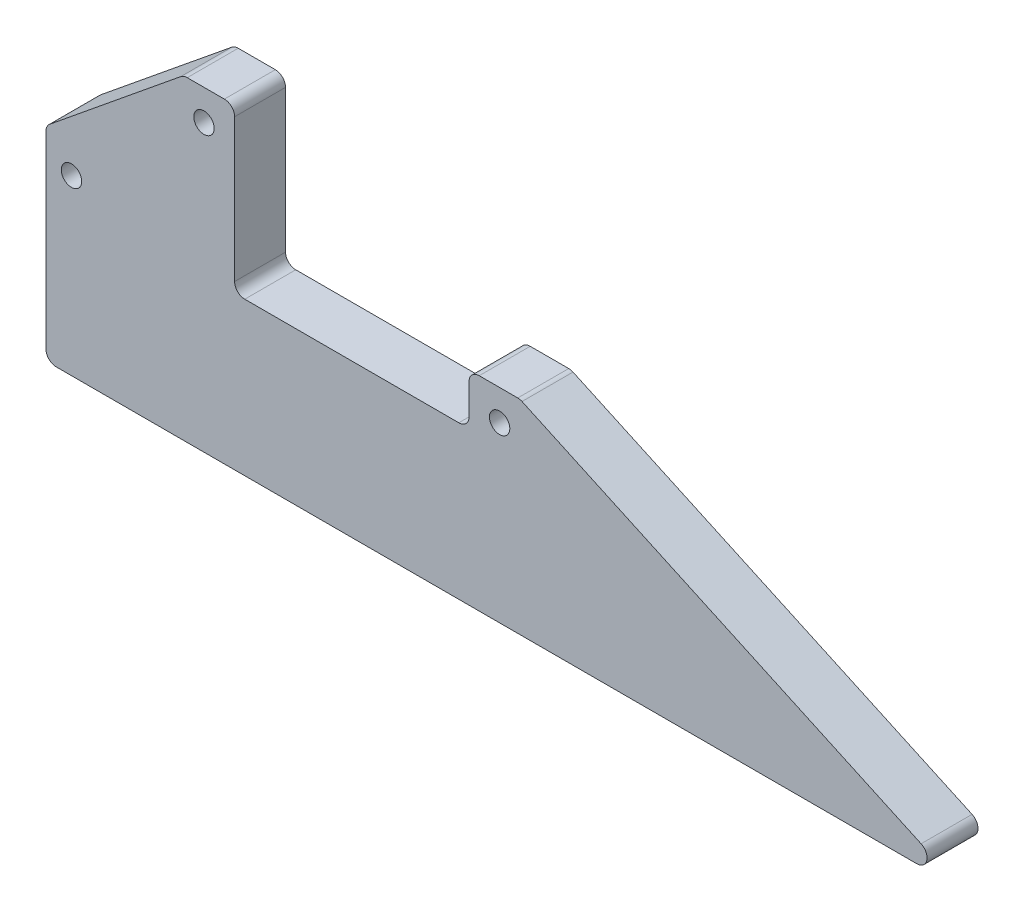
ISO-10303-21;
HEADER;
FILE_DESCRIPTION(('STEP AP214'),'2;1');
FILE_NAME('part.step','',(''),(''),'','','');
FILE_SCHEMA(('AUTOMOTIVE_DESIGN { 1 0 10303 214 1 1 1 1 }'));
ENDSEC;
DATA;
#1=APPLICATION_CONTEXT('core data for automotive mechanical design processes');
#2=APPLICATION_PROTOCOL_DEFINITION('international standard','automotive_design',2000,#1);
#3=PRODUCT_CONTEXT('',#1,'mechanical');
#4=PRODUCT('Part','Part','',(#3));
#5=PRODUCT_RELATED_PRODUCT_CATEGORY('part','',(#4));
#6=PRODUCT_DEFINITION_FORMATION('','',#4);
#7=PRODUCT_DEFINITION_CONTEXT('part definition',#1,'design');
#8=PRODUCT_DEFINITION('design','',#6,#7);
#9=PRODUCT_DEFINITION_SHAPE('','',#8);
#10=(LENGTH_UNIT() NAMED_UNIT(*) SI_UNIT(.MILLI.,.METRE.));
#11=(NAMED_UNIT(*) PLANE_ANGLE_UNIT() SI_UNIT($,.RADIAN.));
#12=(NAMED_UNIT(*) SI_UNIT($,.STERADIAN.) SOLID_ANGLE_UNIT());
#13=UNCERTAINTY_MEASURE_WITH_UNIT(LENGTH_MEASURE(1.E-05),#10,'distance_accuracy_value','');
#14=(GEOMETRIC_REPRESENTATION_CONTEXT(3) GLOBAL_UNCERTAINTY_ASSIGNED_CONTEXT((#13)) GLOBAL_UNIT_ASSIGNED_CONTEXT((#10,
#11,#12)) REPRESENTATION_CONTEXT('',''));
#15=CARTESIAN_POINT('',(0.,0.,0.));
#16=DIRECTION('',(0.,0.,1.));
#17=DIRECTION('',(1.,0.,0.));
#18=AXIS2_PLACEMENT_3D('',#15,#16,#17);
#19=CARTESIAN_POINT('',(-153.,62.,10.));
#20=DIRECTION('',(0.631672951162236,-0.775234985517289,0.));
#21=DIRECTION('',(0.775234985517289,0.631672951162236,0.));
#22=AXIS2_PLACEMENT_3D('',#19,#20,#21);
#23=PLANE('',#22);
#24=DIRECTION('',(-0.775234985517289,-0.631672951162236,0.));
#25=VECTOR('',#24,1.);
#26=CARTESIAN_POINT('',(-153.,62.,0.));
#27=LINE('',#26,#25);
#28=CARTESIAN_POINT('',(-153.551695944639,61.5504699710346,0.));
#29=VERTEX_POINT('',#28);
#30=CARTESIAN_POINT('',(-179.263345902324,40.6002366721801,0.));
#31=VERTEX_POINT('',#30);
#32=EDGE_CURVE('E290',#29,#31,#27,.T.);
#33=ORIENTED_EDGE('',*,*,#32,.T.);
#34=DIRECTION('',(0.,0.,-1.));
#35=VECTOR('',#34,1.);
#36=CARTESIAN_POINT('',(-179.263345902324,40.60023667218,10.));
#37=LINE('',#36,#35);
#38=CARTESIAN_POINT('',(-179.263345902324,40.6002366721801,10.));
#39=VERTEX_POINT('',#38);
#40=EDGE_CURVE('E257',#31,#39,#37,.F.);
#41=ORIENTED_EDGE('',*,*,#40,.T.);
#42=DIRECTION('',(-0.775234985517289,-0.631672951162236,0.));
#43=VECTOR('',#42,1.);
#44=CARTESIAN_POINT('',(-153.,62.,10.));
#45=LINE('',#44,#43);
#46=CARTESIAN_POINT('',(-153.551695944639,61.5504699710346,10.));
#47=VERTEX_POINT('',#46);
#48=EDGE_CURVE('E192',#47,#39,#45,.T.);
#49=ORIENTED_EDGE('',*,*,#48,.F.);
#50=DIRECTION('',(0.,0.,-1.));
#51=VECTOR('',#50,1.);
#52=CARTESIAN_POINT('',(-153.551695944639,61.5504699710346,10.));
#53=LINE('',#52,#51);
#54=EDGE_CURVE('E254',#47,#29,#53,.T.);
#55=ORIENTED_EDGE('',*,*,#54,.T.);
#56=EDGE_LOOP('',(#33,#41,#49,#55));
#57=FACE_BOUND('',#56,.T.);
#58=ADVANCED_FACE('F37',(#57),#23,.F.);
#59=CARTESIAN_POINT('',(-180.,40.,10.));
#60=DIRECTION('',(1.,0.,0.));
#61=DIRECTION('',(0.,0.,-1.));
#62=AXIS2_PLACEMENT_3D('',#59,#60,#61);
#63=PLANE('',#62);
#64=DIRECTION('',(0.,-1.,0.));
#65=VECTOR('',#64,1.);
#66=CARTESIAN_POINT('',(-180.,40.,0.));
#67=LINE('',#66,#65);
#68=CARTESIAN_POINT('',(-180.,39.0497667011455,0.));
#69=VERTEX_POINT('',#68);
#70=CARTESIAN_POINT('',(-180.,1.99999999999998,0.));
#71=VERTEX_POINT('',#70);
#72=EDGE_CURVE('E293',#69,#71,#67,.T.);
#73=ORIENTED_EDGE('',*,*,#72,.T.);
#74=DIRECTION('',(0.,0.,-1.));
#75=VECTOR('',#74,1.);
#76=CARTESIAN_POINT('',(-180.,1.99999999999997,10.));
#77=LINE('',#76,#75);
#78=CARTESIAN_POINT('',(-180.,1.99999999999998,10.));
#79=VERTEX_POINT('',#78);
#80=EDGE_CURVE('E252',#71,#79,#77,.F.);
#81=ORIENTED_EDGE('',*,*,#80,.T.);
#82=DIRECTION('',(0.,-1.,0.));
#83=VECTOR('',#82,1.);
#84=CARTESIAN_POINT('',(-180.,40.,10.));
#85=LINE('',#84,#83);
#86=CARTESIAN_POINT('',(-180.,39.0497667011455,10.));
#87=VERTEX_POINT('',#86);
#88=EDGE_CURVE('E321',#87,#79,#85,.T.);
#89=ORIENTED_EDGE('',*,*,#88,.F.);
#90=DIRECTION('',(0.,0.,-1.));
#91=VECTOR('',#90,1.);
#92=CARTESIAN_POINT('',(-180.,39.0497667011455,10.));
#93=LINE('',#92,#91);
#94=EDGE_CURVE('E249',#87,#69,#93,.T.);
#95=ORIENTED_EDGE('',*,*,#94,.T.);
#96=EDGE_LOOP('',(#73,#81,#89,#95));
#97=FACE_BOUND('',#96,.T.);
#98=ADVANCED_FACE('F369',(#97),#63,.F.);
#99=CARTESIAN_POINT('',(0.,0.,10.));
#100=DIRECTION('',(0.,1.,0.));
#101=DIRECTION('',(-1.,0.,0.));
#102=AXIS2_PLACEMENT_3D('',#99,#100,#101);
#103=PLANE('',#102);
#104=DIRECTION('',(1.,0.,0.));
#105=VECTOR('',#104,1.);
#106=CARTESIAN_POINT('',(0.,0.,0.));
#107=LINE('',#106,#105);
#108=CARTESIAN_POINT('',(-178.,0.,0.));
#109=VERTEX_POINT('',#108);
#110=CARTESIAN_POINT('',(-9.13774477181063,0.,0.));
#111=VERTEX_POINT('',#110);
#112=EDGE_CURVE('E297',#109,#111,#107,.T.);
#113=ORIENTED_EDGE('',*,*,#112,.T.);
#114=DIRECTION('',(0.,0.,-1.));
#115=VECTOR('',#114,1.);
#116=CARTESIAN_POINT('',(-9.13774477181063,0.,10.));
#117=LINE('',#116,#115);
#118=CARTESIAN_POINT('',(-9.13774477181063,0.,10.));
#119=VERTEX_POINT('',#118);
#120=EDGE_CURVE('E247',#111,#119,#117,.F.);
#121=ORIENTED_EDGE('',*,*,#120,.T.);
#122=DIRECTION('',(1.,0.,0.));
#123=VECTOR('',#122,1.);
#124=CARTESIAN_POINT('',(0.,0.,10.));
#125=LINE('',#124,#123);
#126=CARTESIAN_POINT('',(-178.,0.,10.));
#127=VERTEX_POINT('',#126);
#128=EDGE_CURVE('E316',#127,#119,#125,.T.);
#129=ORIENTED_EDGE('',*,*,#128,.F.);
#130=DIRECTION('',(0.,0.,-1.));
#131=VECTOR('',#130,1.);
#132=CARTESIAN_POINT('',(-178.,0.,10.));
#133=LINE('',#132,#131);
#134=EDGE_CURVE('E244',#127,#109,#133,.T.);
#135=ORIENTED_EDGE('',*,*,#134,.T.);
#136=EDGE_LOOP('',(#113,#121,#129,#135));
#137=FACE_BOUND('',#136,.T.);
#138=ADVANCED_FACE('F375',(#137),#103,.F.);
#139=CARTESIAN_POINT('',(-87.,40.,10.));
#140=DIRECTION('',(-0.417733211631421,-0.908569735298342,0.));
#141=DIRECTION('',(0.908569735298342,-0.417733211631421,0.));
#142=AXIS2_PLACEMENT_3D('',#139,#140,#141);
#143=PLANE('',#142);
#144=DIRECTION('',(-0.908569735298341,0.417733211631421,0.));
#145=VECTOR('',#144,1.);
#146=CARTESIAN_POINT('',(-87.,40.,0.));
#147=LINE('',#146,#145);
#148=CARTESIAN_POINT('',(-8.30227834854781,3.81713947059669,0.));
#149=VERTEX_POINT('',#148);
#150=CARTESIAN_POINT('',(-86.6022783485478,39.8171394705967,0.));
#151=VERTEX_POINT('',#150);
#152=EDGE_CURVE('E300',#149,#151,#147,.T.);
#153=ORIENTED_EDGE('',*,*,#152,.T.);
#154=DIRECTION('',(0.,0.,-1.));
#155=VECTOR('',#154,1.);
#156=CARTESIAN_POINT('',(-86.6022783485478,39.8171394705967,10.));
#157=LINE('',#156,#155);
#158=CARTESIAN_POINT('',(-86.6022783485478,39.8171394705967,10.));
#159=VERTEX_POINT('',#158);
#160=EDGE_CURVE('E242',#151,#159,#157,.F.);
#161=ORIENTED_EDGE('',*,*,#160,.T.);
#162=DIRECTION('',(-0.908569735298341,0.417733211631421,0.));
#163=VECTOR('',#162,1.);
#164=CARTESIAN_POINT('',(-87.,40.,10.));
#165=LINE('',#164,#163);
#166=CARTESIAN_POINT('',(-8.30227834854781,3.81713947059669,10.));
#167=VERTEX_POINT('',#166);
#168=EDGE_CURVE('E315',#167,#159,#165,.T.);
#169=ORIENTED_EDGE('',*,*,#168,.F.);
#170=DIRECTION('',(0.,0.,-1.));
#171=VECTOR('',#170,1.);
#172=CARTESIAN_POINT('',(-8.30227834854777,3.81713947059668,10.));
#173=LINE('',#172,#171);
#174=EDGE_CURVE('E239',#167,#149,#173,.T.);
#175=ORIENTED_EDGE('',*,*,#174,.T.);
#176=EDGE_LOOP('',(#153,#161,#169,#175));
#177=FACE_BOUND('',#176,.T.);
#178=ADVANCED_FACE('F428',(#177),#143,.F.);
#179=CARTESIAN_POINT('',(-97.,40.,10.));
#180=DIRECTION('',(0.,-1.,0.));
#181=DIRECTION('',(0.,0.,-1.));
#182=AXIS2_PLACEMENT_3D('',#179,#180,#181);
#183=PLANE('',#182);
#184=DIRECTION('',(-1.,0.,0.));
#185=VECTOR('',#184,1.);
#186=CARTESIAN_POINT('',(-97.,40.,0.));
#187=LINE('',#186,#185);
#188=CARTESIAN_POINT('',(-87.4377447718106,40.,0.));
#189=VERTEX_POINT('',#188);
#190=CARTESIAN_POINT('',(-95.,40.,0.));
#191=VERTEX_POINT('',#190);
#192=EDGE_CURVE('E272',#189,#191,#187,.T.);
#193=ORIENTED_EDGE('',*,*,#192,.T.);
#194=DIRECTION('',(0.,0.,-1.));
#195=VECTOR('',#194,1.);
#196=CARTESIAN_POINT('',(-95.,40.,10.));
#197=LINE('',#196,#195);
#198=CARTESIAN_POINT('',(-95.,40.,10.));
#199=VERTEX_POINT('',#198);
#200=EDGE_CURVE('E224',#191,#199,#197,.F.);
#201=ORIENTED_EDGE('',*,*,#200,.T.);
#202=DIRECTION('',(-1.,0.,0.));
#203=VECTOR('',#202,1.);
#204=CARTESIAN_POINT('',(-97.,40.,10.));
#205=LINE('',#204,#203);
#206=CARTESIAN_POINT('',(-87.4377447718106,40.,10.));
#207=VERTEX_POINT('',#206);
#208=EDGE_CURVE('E285',#207,#199,#205,.T.);
#209=ORIENTED_EDGE('',*,*,#208,.F.);
#210=DIRECTION('',(0.,0.,-1.));
#211=VECTOR('',#210,1.);
#212=CARTESIAN_POINT('',(-87.4377447718106,40.,10.));
#213=LINE('',#212,#211);
#214=EDGE_CURVE('E221',#207,#189,#213,.T.);
#215=ORIENTED_EDGE('',*,*,#214,.T.);
#216=EDGE_LOOP('',(#193,#201,#209,#215));
#217=FACE_BOUND('',#216,.T.);
#218=ADVANCED_FACE('F307',(#217),#183,.F.);
#219=CARTESIAN_POINT('',(-97.,30.,10.));
#220=DIRECTION('',(1.,0.,0.));
#221=DIRECTION('',(0.,0.,-1.));
#222=AXIS2_PLACEMENT_3D('',#219,#220,#221);
#223=PLANE('',#222);
#224=DIRECTION('',(0.,-1.,0.));
#225=VECTOR('',#224,1.);
#226=CARTESIAN_POINT('',(-97.,30.,0.));
#227=LINE('',#226,#225);
#228=CARTESIAN_POINT('',(-97.,38.,0.));
#229=VERTEX_POINT('',#228);
#230=CARTESIAN_POINT('',(-97.,32.,0.));
#231=VERTEX_POINT('',#230);
#232=EDGE_CURVE('E194',#229,#231,#227,.T.);
#233=ORIENTED_EDGE('',*,*,#232,.T.);
#234=DIRECTION('',(0.,0.,-1.));
#235=VECTOR('',#234,1.);
#236=CARTESIAN_POINT('',(-97.,32.,10.));
#237=LINE('',#236,#235);
#238=CARTESIAN_POINT('',(-97.,32.,10.));
#239=VERTEX_POINT('',#238);
#240=EDGE_CURVE('E206',#231,#239,#237,.F.);
#241=ORIENTED_EDGE('',*,*,#240,.T.);
#242=DIRECTION('',(0.,-1.,0.));
#243=VECTOR('',#242,1.);
#244=CARTESIAN_POINT('',(-97.,30.,10.));
#245=LINE('',#244,#243);
#246=CARTESIAN_POINT('',(-97.,38.,10.));
#247=VERTEX_POINT('',#246);
#248=EDGE_CURVE('E280',#247,#239,#245,.T.);
#249=ORIENTED_EDGE('',*,*,#248,.F.);
#250=DIRECTION('',(0.,0.,-1.));
#251=VECTOR('',#250,1.);
#252=CARTESIAN_POINT('',(-97.,38.,10.));
#253=LINE('',#252,#251);
#254=EDGE_CURVE('E203',#247,#229,#253,.T.);
#255=ORIENTED_EDGE('',*,*,#254,.T.);
#256=EDGE_LOOP('',(#233,#241,#249,#255));
#257=FACE_BOUND('',#256,.T.);
#258=ADVANCED_FACE('F268',(#257),#223,.F.);
#259=CARTESIAN_POINT('',(-143.,30.,10.));
#260=DIRECTION('',(0.,-1.,0.));
#261=DIRECTION('',(1.,0.,0.));
#262=AXIS2_PLACEMENT_3D('',#259,#260,#261);
#263=PLANE('',#262);
#264=DIRECTION('',(-1.,0.,0.));
#265=VECTOR('',#264,1.);
#266=CARTESIAN_POINT('',(-143.,30.,0.));
#267=LINE('',#266,#265);
#268=CARTESIAN_POINT('',(-99.,30.,0.));
#269=VERTEX_POINT('',#268);
#270=CARTESIAN_POINT('',(-141.,30.,0.));
#271=VERTEX_POINT('',#270);
#272=EDGE_CURVE('E190',#269,#271,#267,.T.);
#273=ORIENTED_EDGE('',*,*,#272,.T.);
#274=DIRECTION('',(0.,0.,-1.));
#275=VECTOR('',#274,1.);
#276=CARTESIAN_POINT('',(-141.,30.,10.));
#277=LINE('',#276,#275);
#278=CARTESIAN_POINT('',(-141.,30.,10.));
#279=VERTEX_POINT('',#278);
#280=EDGE_CURVE('E168',#271,#279,#277,.F.);
#281=ORIENTED_EDGE('',*,*,#280,.T.);
#282=DIRECTION('',(-1.,0.,0.));
#283=VECTOR('',#282,1.);
#284=CARTESIAN_POINT('',(-143.,30.,10.));
#285=LINE('',#284,#283);
#286=CARTESIAN_POINT('',(-99.,30.,10.));
#287=VERTEX_POINT('',#286);
#288=EDGE_CURVE('E279',#287,#279,#285,.T.);
#289=ORIENTED_EDGE('',*,*,#288,.F.);
#290=DIRECTION('',(0.,0.,-1.));
#291=VECTOR('',#290,1.);
#292=CARTESIAN_POINT('',(-99.,30.,0.));
#293=LINE('',#292,#291);
#294=EDGE_CURVE('E182',#287,#269,#293,.T.);
#295=ORIENTED_EDGE('',*,*,#294,.T.);
#296=EDGE_LOOP('',(#273,#281,#289,#295));
#297=FACE_BOUND('',#296,.T.);
#298=ADVANCED_FACE('F282',(#297),#263,.F.);
#299=CARTESIAN_POINT('',(-143.,62.,10.));
#300=DIRECTION('',(-1.,0.,0.));
#301=DIRECTION('',(0.,0.,1.));
#302=AXIS2_PLACEMENT_3D('',#299,#300,#301);
#303=PLANE('',#302);
#304=DIRECTION('',(0.,1.,0.));
#305=VECTOR('',#304,1.);
#306=CARTESIAN_POINT('',(-143.,62.,10.));
#307=LINE('',#306,#305);
#308=CARTESIAN_POINT('',(-143.,32.,10.));
#309=VERTEX_POINT('',#308);
#310=CARTESIAN_POINT('',(-143.,60.,10.));
#311=VERTEX_POINT('',#310);
#312=EDGE_CURVE('E181',#309,#311,#307,.T.);
#313=ORIENTED_EDGE('',*,*,#312,.F.);
#314=DIRECTION('',(0.,0.,-1.));
#315=VECTOR('',#314,1.);
#316=CARTESIAN_POINT('',(-143.,32.,0.));
#317=LINE('',#316,#315);
#318=CARTESIAN_POINT('',(-143.,32.,0.));
#319=VERTEX_POINT('',#318);
#320=EDGE_CURVE('E167',#309,#319,#317,.T.);
#321=ORIENTED_EDGE('',*,*,#320,.T.);
#322=DIRECTION('',(0.,1.,0.));
#323=VECTOR('',#322,1.);
#324=CARTESIAN_POINT('',(-143.,62.,0.));
#325=LINE('',#324,#323);
#326=CARTESIAN_POINT('',(-143.,60.,0.));
#327=VERTEX_POINT('',#326);
#328=EDGE_CURVE('E179',#319,#327,#325,.T.);
#329=ORIENTED_EDGE('',*,*,#328,.T.);
#330=DIRECTION('',(0.,0.,-1.));
#331=VECTOR('',#330,1.);
#332=CARTESIAN_POINT('',(-143.,60.,10.));
#333=LINE('',#332,#331);
#334=EDGE_CURVE('E183',#327,#311,#333,.F.);
#335=ORIENTED_EDGE('',*,*,#334,.T.);
#336=EDGE_LOOP('',(#313,#321,#329,#335));
#337=FACE_BOUND('',#336,.T.);
#338=ADVANCED_FACE('F178',(#337),#303,.F.);
#339=CARTESIAN_POINT('',(-153.,62.,10.));
#340=DIRECTION('',(0.,-1.,0.));
#341=DIRECTION('',(0.,0.,-1.));
#342=AXIS2_PLACEMENT_3D('',#339,#340,#341);
#343=PLANE('',#342);
#344=DIRECTION('',(-1.,0.,0.));
#345=VECTOR('',#344,1.);
#346=CARTESIAN_POINT('',(-153.,62.,0.));
#347=LINE('',#346,#345);
#348=CARTESIAN_POINT('',(-145.,62.,0.));
#349=VERTEX_POINT('',#348);
#350=CARTESIAN_POINT('',(-152.288350042315,62.,0.));
#351=VERTEX_POINT('',#350);
#352=EDGE_CURVE('E189',#349,#351,#347,.T.);
#353=ORIENTED_EDGE('',*,*,#352,.T.);
#354=DIRECTION('',(0.,0.,-1.));
#355=VECTOR('',#354,1.);
#356=CARTESIAN_POINT('',(-152.288350042315,62.,10.));
#357=LINE('',#356,#355);
#358=CARTESIAN_POINT('',(-152.288350042315,62.,10.));
#359=VERTEX_POINT('',#358);
#360=EDGE_CURVE('E52',#351,#359,#357,.F.);
#361=ORIENTED_EDGE('',*,*,#360,.T.);
#362=DIRECTION('',(-1.,0.,0.));
#363=VECTOR('',#362,1.);
#364=CARTESIAN_POINT('',(-153.,62.,10.));
#365=LINE('',#364,#363);
#366=CARTESIAN_POINT('',(-145.,62.,10.));
#367=VERTEX_POINT('',#366);
#368=EDGE_CURVE('E198',#367,#359,#365,.T.);
#369=ORIENTED_EDGE('',*,*,#368,.F.);
#370=DIRECTION('',(0.,0.,-1.));
#371=VECTOR('',#370,1.);
#372=CARTESIAN_POINT('',(-145.,62.,10.));
#373=LINE('',#372,#371);
#374=EDGE_CURVE('E259',#367,#349,#373,.T.);
#375=ORIENTED_EDGE('',*,*,#374,.T.);
#376=EDGE_LOOP('',(#353,#361,#369,#375));
#377=FACE_BOUND('',#376,.T.);
#378=ADVANCED_FACE('F348',(#377),#343,.F.);
#379=CARTESIAN_POINT('',(0.,0.,10.));
#380=DIRECTION('',(0.,0.,1.));
#381=DIRECTION('',(1.,0.,0.));
#382=AXIS2_PLACEMENT_3D('',#379,#380,#381);
#383=PLANE('',#382);
#384=CARTESIAN_POINT('',(-149.,56.,10.));
#385=DIRECTION('',(0.,0.,1.));
#386=DIRECTION('',(1.,0.,0.));
#387=AXIS2_PLACEMENT_3D('',#384,#385,#386);
#388=CIRCLE('',#387,1.99999999999997);
#389=CARTESIAN_POINT('',(-147.,56.,10.));
#390=VERTEX_POINT('',#389);
#391=EDGE_CURVE('E340',#390,#390,#388,.T.);
#392=ORIENTED_EDGE('',*,*,#391,.F.);
#393=EDGE_LOOP('',(#392));
#394=FACE_BOUND('',#393,.T.);
#395=CARTESIAN_POINT('',(-90.9999999999999,34.,10.));
#396=DIRECTION('',(0.,0.,1.));
#397=DIRECTION('',(1.,0.,0.));
#398=AXIS2_PLACEMENT_3D('',#395,#396,#397);
#399=CIRCLE('',#398,1.99999999999999);
#400=CARTESIAN_POINT('',(-88.9999999999999,34.,10.));
#401=VERTEX_POINT('',#400);
#402=EDGE_CURVE('E334',#401,#401,#399,.T.);
#403=ORIENTED_EDGE('',*,*,#402,.F.);
#404=EDGE_LOOP('',(#403));
#405=FACE_BOUND('',#404,.T.);
#406=CARTESIAN_POINT('',(-175.,34.,10.));
#407=DIRECTION('',(0.,0.,1.));
#408=DIRECTION('',(1.,0.,0.));
#409=AXIS2_PLACEMENT_3D('',#406,#407,#408);
#410=CIRCLE('',#409,2.);
#411=CARTESIAN_POINT('',(-173.,34.,10.));
#412=VERTEX_POINT('',#411);
#413=EDGE_CURVE('E328',#412,#412,#410,.T.);
#414=ORIENTED_EDGE('',*,*,#413,.F.);
#415=EDGE_LOOP('',(#414));
#416=FACE_BOUND('',#415,.T.);
#417=ORIENTED_EDGE('',*,*,#208,.T.);
#418=CARTESIAN_POINT('',(-95.,38.,10.));
#419=DIRECTION('',(0.,0.,1.));
#420=DIRECTION('',(1.,0.,0.));
#421=AXIS2_PLACEMENT_3D('',#418,#419,#420);
#422=CIRCLE('',#421,2.);
#423=EDGE_CURVE('E237',#199,#247,#422,.T.);
#424=ORIENTED_EDGE('',*,*,#423,.T.);
#425=ORIENTED_EDGE('',*,*,#248,.T.);
#426=CARTESIAN_POINT('',(-99.,32.,10.));
#427=DIRECTION('',(0.,0.,1.));
#428=DIRECTION('',(1.,0.,0.));
#429=AXIS2_PLACEMENT_3D('',#426,#427,#428);
#430=CIRCLE('',#429,2.);
#431=EDGE_CURVE('E11',#239,#287,#430,.F.);
#432=ORIENTED_EDGE('',*,*,#431,.T.);
#433=ORIENTED_EDGE('',*,*,#288,.T.);
#434=CARTESIAN_POINT('',(-141.,32.,10.));
#435=DIRECTION('',(0.,0.,1.));
#436=DIRECTION('',(1.,0.,0.));
#437=AXIS2_PLACEMENT_3D('',#434,#435,#436);
#438=CIRCLE('',#437,2.);
#439=EDGE_CURVE('E173',#279,#309,#438,.F.);
#440=ORIENTED_EDGE('',*,*,#439,.T.);
#441=ORIENTED_EDGE('',*,*,#312,.T.);
#442=CARTESIAN_POINT('',(-145.,60.,10.));
#443=DIRECTION('',(0.,0.,1.));
#444=DIRECTION('',(1.,0.,0.));
#445=AXIS2_PLACEMENT_3D('',#442,#443,#444);
#446=CIRCLE('',#445,2.);
#447=EDGE_CURVE('E59',#311,#367,#446,.T.);
#448=ORIENTED_EDGE('',*,*,#447,.T.);
#449=ORIENTED_EDGE('',*,*,#368,.T.);
#450=CARTESIAN_POINT('',(-152.288350042315,60.,10.));
#451=DIRECTION('',(0.,0.,1.));
#452=DIRECTION('',(1.,0.,0.));
#453=AXIS2_PLACEMENT_3D('',#450,#451,#452);
#454=CIRCLE('',#453,2.);
#455=EDGE_CURVE('E227',#359,#47,#454,.T.);
#456=ORIENTED_EDGE('',*,*,#455,.T.);
#457=ORIENTED_EDGE('',*,*,#48,.T.);
#458=CARTESIAN_POINT('',(-178.,39.0497667011455,10.));
#459=DIRECTION('',(0.,0.,1.));
#460=DIRECTION('',(1.,0.,0.));
#461=AXIS2_PLACEMENT_3D('',#458,#459,#460);
#462=CIRCLE('',#461,2.);
#463=EDGE_CURVE('E229',#39,#87,#462,.T.);
#464=ORIENTED_EDGE('',*,*,#463,.T.);
#465=ORIENTED_EDGE('',*,*,#88,.T.);
#466=CARTESIAN_POINT('',(-178.,1.99999999999997,10.));
#467=DIRECTION('',(0.,0.,1.));
#468=DIRECTION('',(1.,0.,0.));
#469=AXIS2_PLACEMENT_3D('',#466,#467,#468);
#470=CIRCLE('',#469,2.);
#471=EDGE_CURVE('E231',#79,#127,#470,.T.);
#472=ORIENTED_EDGE('',*,*,#471,.T.);
#473=ORIENTED_EDGE('',*,*,#128,.T.);
#474=CARTESIAN_POINT('',(-9.13774477181063,2.,10.));
#475=DIRECTION('',(0.,0.,1.));
#476=DIRECTION('',(1.,0.,0.));
#477=AXIS2_PLACEMENT_3D('',#474,#475,#476);
#478=CIRCLE('',#477,2.);
#479=EDGE_CURVE('E233',#119,#167,#478,.T.);
#480=ORIENTED_EDGE('',*,*,#479,.T.);
#481=ORIENTED_EDGE('',*,*,#168,.T.);
#482=CARTESIAN_POINT('',(-87.4377447718106,38.,10.));
#483=DIRECTION('',(0.,0.,1.));
#484=DIRECTION('',(1.,0.,0.));
#485=AXIS2_PLACEMENT_3D('',#482,#483,#484);
#486=CIRCLE('',#485,2.);
#487=EDGE_CURVE('E235',#159,#207,#486,.T.);
#488=ORIENTED_EDGE('',*,*,#487,.T.);
#489=EDGE_LOOP('',(#417,#424,#425,#432,#433,#440,#441,#448,#449,#456,#457,#464,#465,#472,#473,
#480,#481,#488));
#490=FACE_BOUND('',#489,.T.);
#491=ADVANCED_FACE('F278',(#394,#405,#416,#490),#383,.T.);
#492=CARTESIAN_POINT('',(0.,0.,0.));
#493=DIRECTION('',(0.,0.,1.));
#494=DIRECTION('',(1.,0.,0.));
#495=AXIS2_PLACEMENT_3D('',#492,#493,#494);
#496=PLANE('',#495);
#497=CARTESIAN_POINT('',(-149.,56.,0.));
#498=DIRECTION('',(0.,0.,1.));
#499=DIRECTION('',(1.,0.,0.));
#500=AXIS2_PLACEMENT_3D('',#497,#498,#499);
#501=CIRCLE('',#500,1.99999999999997);
#502=CARTESIAN_POINT('',(-147.,56.,0.));
#503=VERTEX_POINT('',#502);
#504=EDGE_CURVE('E337',#503,#503,#501,.T.);
#505=ORIENTED_EDGE('',*,*,#504,.T.);
#506=EDGE_LOOP('',(#505));
#507=FACE_BOUND('',#506,.T.);
#508=CARTESIAN_POINT('',(-90.9999999999999,34.,0.));
#509=DIRECTION('',(0.,0.,1.));
#510=DIRECTION('',(1.,0.,0.));
#511=AXIS2_PLACEMENT_3D('',#508,#509,#510);
#512=CIRCLE('',#511,1.99999999999999);
#513=CARTESIAN_POINT('',(-88.9999999999999,34.,0.));
#514=VERTEX_POINT('',#513);
#515=EDGE_CURVE('E331',#514,#514,#512,.T.);
#516=ORIENTED_EDGE('',*,*,#515,.T.);
#517=EDGE_LOOP('',(#516));
#518=FACE_BOUND('',#517,.T.);
#519=CARTESIAN_POINT('',(-175.,34.,0.));
#520=DIRECTION('',(0.,0.,1.));
#521=DIRECTION('',(1.,0.,0.));
#522=AXIS2_PLACEMENT_3D('',#519,#520,#521);
#523=CIRCLE('',#522,1.99999999999997);
#524=CARTESIAN_POINT('',(-173.,34.,0.));
#525=VERTEX_POINT('',#524);
#526=EDGE_CURVE('E294',#525,#525,#523,.T.);
#527=ORIENTED_EDGE('',*,*,#526,.T.);
#528=EDGE_LOOP('',(#527));
#529=FACE_BOUND('',#528,.T.);
#530=ORIENTED_EDGE('',*,*,#232,.F.);
#531=CARTESIAN_POINT('',(-95.,38.,0.));
#532=DIRECTION('',(0.,0.,1.));
#533=DIRECTION('',(1.,0.,0.));
#534=AXIS2_PLACEMENT_3D('',#531,#532,#533);
#535=CIRCLE('',#534,2.);
#536=EDGE_CURVE('E219',#229,#191,#535,.F.);
#537=ORIENTED_EDGE('',*,*,#536,.T.);
#538=ORIENTED_EDGE('',*,*,#192,.F.);
#539=CARTESIAN_POINT('',(-87.4377447718106,38.,0.));
#540=DIRECTION('',(0.,0.,1.));
#541=DIRECTION('',(1.,0.,0.));
#542=AXIS2_PLACEMENT_3D('',#539,#540,#541);
#543=CIRCLE('',#542,2.);
#544=EDGE_CURVE('E217',#189,#151,#543,.F.);
#545=ORIENTED_EDGE('',*,*,#544,.T.);
#546=ORIENTED_EDGE('',*,*,#152,.F.);
#547=CARTESIAN_POINT('',(-9.13774477181063,2.,0.));
#548=DIRECTION('',(0.,0.,1.));
#549=DIRECTION('',(1.,0.,0.));
#550=AXIS2_PLACEMENT_3D('',#547,#548,#549);
#551=CIRCLE('',#550,2.);
#552=EDGE_CURVE('E215',#149,#111,#551,.F.);
#553=ORIENTED_EDGE('',*,*,#552,.T.);
#554=ORIENTED_EDGE('',*,*,#112,.F.);
#555=CARTESIAN_POINT('',(-178.,1.99999999999997,0.));
#556=DIRECTION('',(0.,0.,1.));
#557=DIRECTION('',(1.,0.,0.));
#558=AXIS2_PLACEMENT_3D('',#555,#556,#557);
#559=CIRCLE('',#558,2.);
#560=EDGE_CURVE('E213',#109,#71,#559,.F.);
#561=ORIENTED_EDGE('',*,*,#560,.T.);
#562=ORIENTED_EDGE('',*,*,#72,.F.);
#563=CARTESIAN_POINT('',(-178.,39.0497667011455,0.));
#564=DIRECTION('',(0.,0.,1.));
#565=DIRECTION('',(1.,0.,0.));
#566=AXIS2_PLACEMENT_3D('',#563,#564,#565);
#567=CIRCLE('',#566,2.);
#568=EDGE_CURVE('E211',#69,#31,#567,.F.);
#569=ORIENTED_EDGE('',*,*,#568,.T.);
#570=ORIENTED_EDGE('',*,*,#32,.F.);
#571=CARTESIAN_POINT('',(-152.288350042315,60.,0.));
#572=DIRECTION('',(0.,0.,1.));
#573=DIRECTION('',(1.,0.,0.));
#574=AXIS2_PLACEMENT_3D('',#571,#572,#573);
#575=CIRCLE('',#574,2.);
#576=EDGE_CURVE('E209',#29,#351,#575,.F.);
#577=ORIENTED_EDGE('',*,*,#576,.T.);
#578=ORIENTED_EDGE('',*,*,#352,.F.);
#579=CARTESIAN_POINT('',(-145.,60.,0.));
#580=DIRECTION('',(0.,0.,1.));
#581=DIRECTION('',(1.,0.,0.));
#582=AXIS2_PLACEMENT_3D('',#579,#580,#581);
#583=CIRCLE('',#582,2.);
#584=EDGE_CURVE('E188',#349,#327,#583,.F.);
#585=ORIENTED_EDGE('',*,*,#584,.T.);
#586=ORIENTED_EDGE('',*,*,#328,.F.);
#587=CARTESIAN_POINT('',(-141.,32.,0.));
#588=DIRECTION('',(0.,0.,1.));
#589=DIRECTION('',(1.,0.,0.));
#590=AXIS2_PLACEMENT_3D('',#587,#588,#589);
#591=CIRCLE('',#590,2.);
#592=EDGE_CURVE('E163',#319,#271,#591,.T.);
#593=ORIENTED_EDGE('',*,*,#592,.T.);
#594=ORIENTED_EDGE('',*,*,#272,.F.);
#595=CARTESIAN_POINT('',(-99.,32.,0.));
#596=DIRECTION('',(0.,0.,1.));
#597=DIRECTION('',(1.,0.,0.));
#598=AXIS2_PLACEMENT_3D('',#595,#596,#597);
#599=CIRCLE('',#598,2.);
#600=EDGE_CURVE('E45',#269,#231,#599,.T.);
#601=ORIENTED_EDGE('',*,*,#600,.T.);
#602=EDGE_LOOP('',(#530,#537,#538,#545,#546,#553,#554,#561,#562,#569,#570,#577,#578,#585,#586,
#593,#594,#601));
#603=FACE_BOUND('',#602,.T.);
#604=ADVANCED_FACE('F186',(#507,#518,#529,#603),#496,.F.);
#605=CARTESIAN_POINT('',(-175.,34.,10.));
#606=DIRECTION('',(0.,0.,1.));
#607=DIRECTION('',(1.,0.,0.));
#608=AXIS2_PLACEMENT_3D('',#605,#606,#607);
#609=CYLINDRICAL_SURFACE('',#608,1.99999999999999);
#610=ORIENTED_EDGE('',*,*,#526,.F.);
#611=EDGE_LOOP('',(#610));
#612=FACE_BOUND('',#611,.T.);
#613=ORIENTED_EDGE('',*,*,#413,.T.);
#614=EDGE_LOOP('',(#613));
#615=FACE_BOUND('',#614,.T.);
#616=ADVANCED_FACE('F354',(#612,#615),#609,.F.);
#617=CARTESIAN_POINT('',(-90.9999999999999,34.,10.));
#618=DIRECTION('',(0.,0.,1.));
#619=DIRECTION('',(1.,0.,0.));
#620=AXIS2_PLACEMENT_3D('',#617,#618,#619);
#621=CYLINDRICAL_SURFACE('',#620,1.99999999999999);
#622=ORIENTED_EDGE('',*,*,#515,.F.);
#623=EDGE_LOOP('',(#622));
#624=FACE_BOUND('',#623,.T.);
#625=ORIENTED_EDGE('',*,*,#402,.T.);
#626=EDGE_LOOP('',(#625));
#627=FACE_BOUND('',#626,.T.);
#628=ADVANCED_FACE('F356',(#624,#627),#621,.F.);
#629=CARTESIAN_POINT('',(-149.,56.,10.));
#630=DIRECTION('',(0.,0.,1.));
#631=DIRECTION('',(1.,0.,0.));
#632=AXIS2_PLACEMENT_3D('',#629,#630,#631);
#633=CYLINDRICAL_SURFACE('',#632,1.99999999999997);
#634=ORIENTED_EDGE('',*,*,#504,.F.);
#635=EDGE_LOOP('',(#634));
#636=FACE_BOUND('',#635,.T.);
#637=ORIENTED_EDGE('',*,*,#391,.T.);
#638=EDGE_LOOP('',(#637));
#639=FACE_BOUND('',#638,.T.);
#640=ADVANCED_FACE('F344',(#636,#639),#633,.F.);
#641=CARTESIAN_POINT('',(-141.,32.,10.));
#642=DIRECTION('',(0.,0.,1.));
#643=DIRECTION('',(1.,0.,0.));
#644=AXIS2_PLACEMENT_3D('',#641,#642,#643);
#645=CYLINDRICAL_SURFACE('',#644,2.);
#646=ORIENTED_EDGE('',*,*,#439,.F.);
#647=ORIENTED_EDGE('',*,*,#280,.F.);
#648=ORIENTED_EDGE('',*,*,#592,.F.);
#649=ORIENTED_EDGE('',*,*,#320,.F.);
#650=EDGE_LOOP('',(#646,#647,#648,#649));
#651=FACE_BOUND('',#650,.T.);
#652=ADVANCED_FACE('F166',(#651),#645,.F.);
#653=CARTESIAN_POINT('',(-99.,32.,10.));
#654=DIRECTION('',(0.,0.,1.));
#655=DIRECTION('',(1.,0.,0.));
#656=AXIS2_PLACEMENT_3D('',#653,#654,#655);
#657=CYLINDRICAL_SURFACE('',#656,2.);
#658=ORIENTED_EDGE('',*,*,#431,.F.);
#659=ORIENTED_EDGE('',*,*,#240,.F.);
#660=ORIENTED_EDGE('',*,*,#600,.F.);
#661=ORIENTED_EDGE('',*,*,#294,.F.);
#662=EDGE_LOOP('',(#658,#659,#660,#661));
#663=FACE_BOUND('',#662,.T.);
#664=ADVANCED_FACE('F274',(#663),#657,.F.);
#665=CARTESIAN_POINT('',(-95.,38.,10.));
#666=DIRECTION('',(0.,0.,-1.));
#667=DIRECTION('',(-1.,0.,0.));
#668=AXIS2_PLACEMENT_3D('',#665,#666,#667);
#669=CYLINDRICAL_SURFACE('',#668,2.);
#670=ORIENTED_EDGE('',*,*,#423,.F.);
#671=ORIENTED_EDGE('',*,*,#200,.F.);
#672=ORIENTED_EDGE('',*,*,#536,.F.);
#673=ORIENTED_EDGE('',*,*,#254,.F.);
#674=EDGE_LOOP('',(#670,#671,#672,#673));
#675=FACE_BOUND('',#674,.T.);
#676=ADVANCED_FACE('F312',(#675),#669,.T.);
#677=CARTESIAN_POINT('',(-87.4377447718106,38.,10.));
#678=DIRECTION('',(0.,0.,-1.));
#679=DIRECTION('',(-1.,0.,0.));
#680=AXIS2_PLACEMENT_3D('',#677,#678,#679);
#681=CYLINDRICAL_SURFACE('',#680,2.);
#682=ORIENTED_EDGE('',*,*,#487,.F.);
#683=ORIENTED_EDGE('',*,*,#160,.F.);
#684=ORIENTED_EDGE('',*,*,#544,.F.);
#685=ORIENTED_EDGE('',*,*,#214,.F.);
#686=EDGE_LOOP('',(#682,#683,#684,#685));
#687=FACE_BOUND('',#686,.T.);
#688=ADVANCED_FACE('F386',(#687),#681,.T.);
#689=CARTESIAN_POINT('',(-9.13774477181063,2.,10.));
#690=DIRECTION('',(0.,0.,-1.));
#691=DIRECTION('',(-1.,0.,0.));
#692=AXIS2_PLACEMENT_3D('',#689,#690,#691);
#693=CYLINDRICAL_SURFACE('',#692,2.);
#694=ORIENTED_EDGE('',*,*,#479,.F.);
#695=ORIENTED_EDGE('',*,*,#120,.F.);
#696=ORIENTED_EDGE('',*,*,#552,.F.);
#697=ORIENTED_EDGE('',*,*,#174,.F.);
#698=EDGE_LOOP('',(#694,#695,#696,#697));
#699=FACE_BOUND('',#698,.T.);
#700=ADVANCED_FACE('F389',(#699),#693,.T.);
#701=CARTESIAN_POINT('',(-178.,1.99999999999997,10.));
#702=DIRECTION('',(0.,0.,-1.));
#703=DIRECTION('',(-1.,0.,0.));
#704=AXIS2_PLACEMENT_3D('',#701,#702,#703);
#705=CYLINDRICAL_SURFACE('',#704,2.);
#706=ORIENTED_EDGE('',*,*,#471,.F.);
#707=ORIENTED_EDGE('',*,*,#80,.F.);
#708=ORIENTED_EDGE('',*,*,#560,.F.);
#709=ORIENTED_EDGE('',*,*,#134,.F.);
#710=EDGE_LOOP('',(#706,#707,#708,#709));
#711=FACE_BOUND('',#710,.T.);
#712=ADVANCED_FACE('F393',(#711),#705,.T.);
#713=CARTESIAN_POINT('',(-178.,39.0497667011455,10.));
#714=DIRECTION('',(0.,0.,-1.));
#715=DIRECTION('',(-1.,0.,0.));
#716=AXIS2_PLACEMENT_3D('',#713,#714,#715);
#717=CYLINDRICAL_SURFACE('',#716,2.);
#718=ORIENTED_EDGE('',*,*,#463,.F.);
#719=ORIENTED_EDGE('',*,*,#40,.F.);
#720=ORIENTED_EDGE('',*,*,#568,.F.);
#721=ORIENTED_EDGE('',*,*,#94,.F.);
#722=EDGE_LOOP('',(#718,#719,#720,#721));
#723=FACE_BOUND('',#722,.T.);
#724=ADVANCED_FACE('F397',(#723),#717,.T.);
#725=CARTESIAN_POINT('',(-152.288350042315,60.,10.));
#726=DIRECTION('',(0.,0.,-1.));
#727=DIRECTION('',(-1.,0.,0.));
#728=AXIS2_PLACEMENT_3D('',#725,#726,#727);
#729=CYLINDRICAL_SURFACE('',#728,2.);
#730=ORIENTED_EDGE('',*,*,#455,.F.);
#731=ORIENTED_EDGE('',*,*,#360,.F.);
#732=ORIENTED_EDGE('',*,*,#576,.F.);
#733=ORIENTED_EDGE('',*,*,#54,.F.);
#734=EDGE_LOOP('',(#730,#731,#732,#733));
#735=FACE_BOUND('',#734,.T.);
#736=ADVANCED_FACE('F400',(#735),#729,.T.);
#737=CARTESIAN_POINT('',(-145.,60.,10.));
#738=DIRECTION('',(0.,0.,-1.));
#739=DIRECTION('',(-1.,0.,0.));
#740=AXIS2_PLACEMENT_3D('',#737,#738,#739);
#741=CYLINDRICAL_SURFACE('',#740,2.);
#742=ORIENTED_EDGE('',*,*,#447,.F.);
#743=ORIENTED_EDGE('',*,*,#334,.F.);
#744=ORIENTED_EDGE('',*,*,#584,.F.);
#745=ORIENTED_EDGE('',*,*,#374,.F.);
#746=EDGE_LOOP('',(#742,#743,#744,#745));
#747=FACE_BOUND('',#746,.T.);
#748=ADVANCED_FACE('F39',(#747),#741,.T.);
#749=CLOSED_SHELL('',(#58,#98,#138,#178,#218,#258,#298,#338,#378,#491,#604,#616,#628,#640,#652,
#664,#676,#688,#700,#712,#724,#736,#748));
#750=MANIFOLD_SOLID_BREP('B2',#749);
#751=ADVANCED_BREP_SHAPE_REPRESENTATION('',(#18,#750),#14);
#752=SHAPE_DEFINITION_REPRESENTATION(#9,#751);
ENDSEC;
END-ISO-10303-21;
